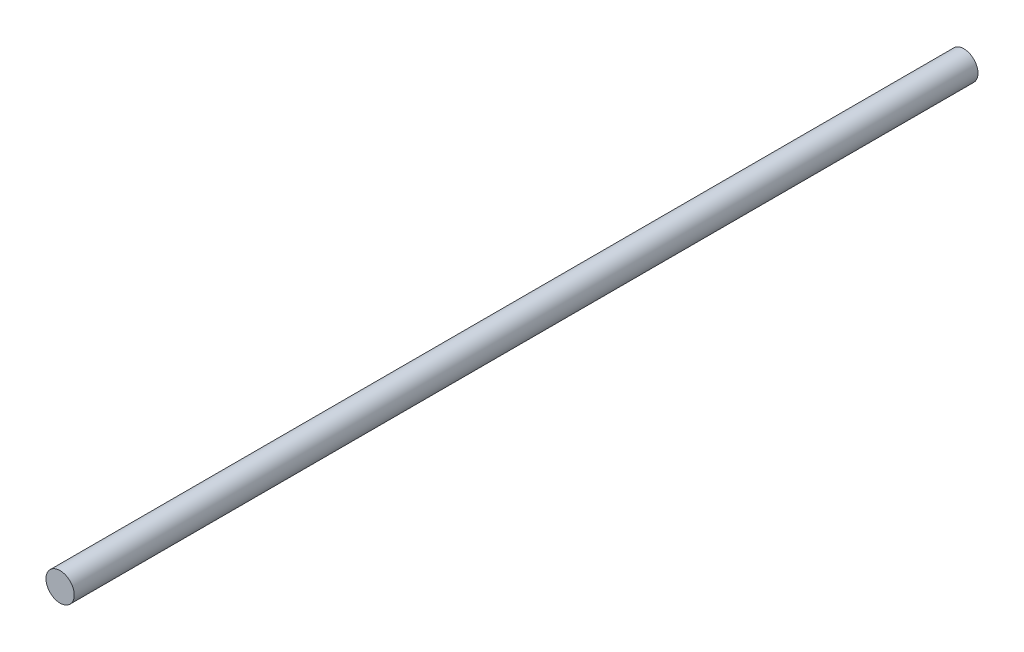
ISO-10303-21;
HEADER;
FILE_DESCRIPTION(('STEP AP214'),'2;1');
FILE_NAME('part.step','',(''),(''),'','','');
FILE_SCHEMA(('AUTOMOTIVE_DESIGN { 1 0 10303 214 1 1 1 1 }'));
ENDSEC;
DATA;
#1=APPLICATION_CONTEXT('core data for automotive mechanical design processes');
#2=APPLICATION_PROTOCOL_DEFINITION('international standard','automotive_design',2000,#1);
#3=PRODUCT_CONTEXT('',#1,'mechanical');
#4=PRODUCT('Part','Part','',(#3));
#5=PRODUCT_RELATED_PRODUCT_CATEGORY('part','',(#4));
#6=PRODUCT_DEFINITION_FORMATION('','',#4);
#7=PRODUCT_DEFINITION_CONTEXT('part definition',#1,'design');
#8=PRODUCT_DEFINITION('design','',#6,#7);
#9=PRODUCT_DEFINITION_SHAPE('','',#8);
#10=(LENGTH_UNIT() NAMED_UNIT(*) SI_UNIT(.MILLI.,.METRE.));
#11=(NAMED_UNIT(*) PLANE_ANGLE_UNIT() SI_UNIT($,.RADIAN.));
#12=(NAMED_UNIT(*) SI_UNIT($,.STERADIAN.) SOLID_ANGLE_UNIT());
#13=UNCERTAINTY_MEASURE_WITH_UNIT(LENGTH_MEASURE(1.E-05),#10,'distance_accuracy_value','');
#14=(GEOMETRIC_REPRESENTATION_CONTEXT(3) GLOBAL_UNCERTAINTY_ASSIGNED_CONTEXT((#13)) GLOBAL_UNIT_ASSIGNED_CONTEXT((#10,
#11,#12)) REPRESENTATION_CONTEXT('',''));
#15=CARTESIAN_POINT('',(0.,0.,0.));
#16=DIRECTION('',(0.,0.,1.));
#17=DIRECTION('',(1.,0.,0.));
#18=AXIS2_PLACEMENT_3D('',#15,#16,#17);
#19=CARTESIAN_POINT('',(0.,0.,304.8));
#20=DIRECTION('',(0.,0.,-1.));
#21=DIRECTION('',(-1.,0.,0.));
#22=AXIS2_PLACEMENT_3D('',#19,#20,#21);
#23=CYLINDRICAL_SURFACE('',#22,4.7625);
#24=CARTESIAN_POINT('',(0.,0.,304.8));
#25=DIRECTION('',(0.,0.,1.));
#26=DIRECTION('',(1.,0.,0.));
#27=AXIS2_PLACEMENT_3D('',#24,#25,#26);
#28=CIRCLE('',#27,4.7625);
#29=CARTESIAN_POINT('',(4.7625,0.,304.8));
#30=VERTEX_POINT('',#29);
#31=EDGE_CURVE('E10',#30,#30,#28,.T.);
#32=ORIENTED_EDGE('',*,*,#31,.F.);
#33=EDGE_LOOP('',(#32));
#34=FACE_BOUND('',#33,.T.);
#35=CARTESIAN_POINT('',(0.,0.,0.));
#36=DIRECTION('',(0.,0.,1.));
#37=DIRECTION('',(1.,0.,0.));
#38=AXIS2_PLACEMENT_3D('',#35,#36,#37);
#39=CIRCLE('',#38,4.7625);
#40=CARTESIAN_POINT('',(4.7625,0.,0.));
#41=VERTEX_POINT('',#40);
#42=EDGE_CURVE('E44',#41,#41,#39,.T.);
#43=ORIENTED_EDGE('',*,*,#42,.T.);
#44=EDGE_LOOP('',(#43));
#45=FACE_BOUND('',#44,.T.);
#46=ADVANCED_FACE('F41',(#34,#45),#23,.T.);
#47=CARTESIAN_POINT('',(0.,0.,304.8));
#48=DIRECTION('',(0.,0.,1.));
#49=DIRECTION('',(1.,0.,0.));
#50=AXIS2_PLACEMENT_3D('',#47,#48,#49);
#51=PLANE('',#50);
#52=ORIENTED_EDGE('',*,*,#31,.T.);
#53=EDGE_LOOP('',(#52));
#54=FACE_BOUND('',#53,.T.);
#55=ADVANCED_FACE('F56',(#54),#51,.T.);
#56=CARTESIAN_POINT('',(0.,0.,0.));
#57=DIRECTION('',(0.,0.,1.));
#58=DIRECTION('',(1.,0.,0.));
#59=AXIS2_PLACEMENT_3D('',#56,#57,#58);
#60=PLANE('',#59);
#61=ORIENTED_EDGE('',*,*,#42,.F.);
#62=EDGE_LOOP('',(#61));
#63=FACE_BOUND('',#62,.T.);
#64=ADVANCED_FACE('F54',(#63),#60,.F.);
#65=CLOSED_SHELL('',(#46,#55,#64));
#66=MANIFOLD_SOLID_BREP('B2',#65);
#67=ADVANCED_BREP_SHAPE_REPRESENTATION('',(#18,#66),#14);
#68=SHAPE_DEFINITION_REPRESENTATION(#9,#67);
ENDSEC;
END-ISO-10303-21;
